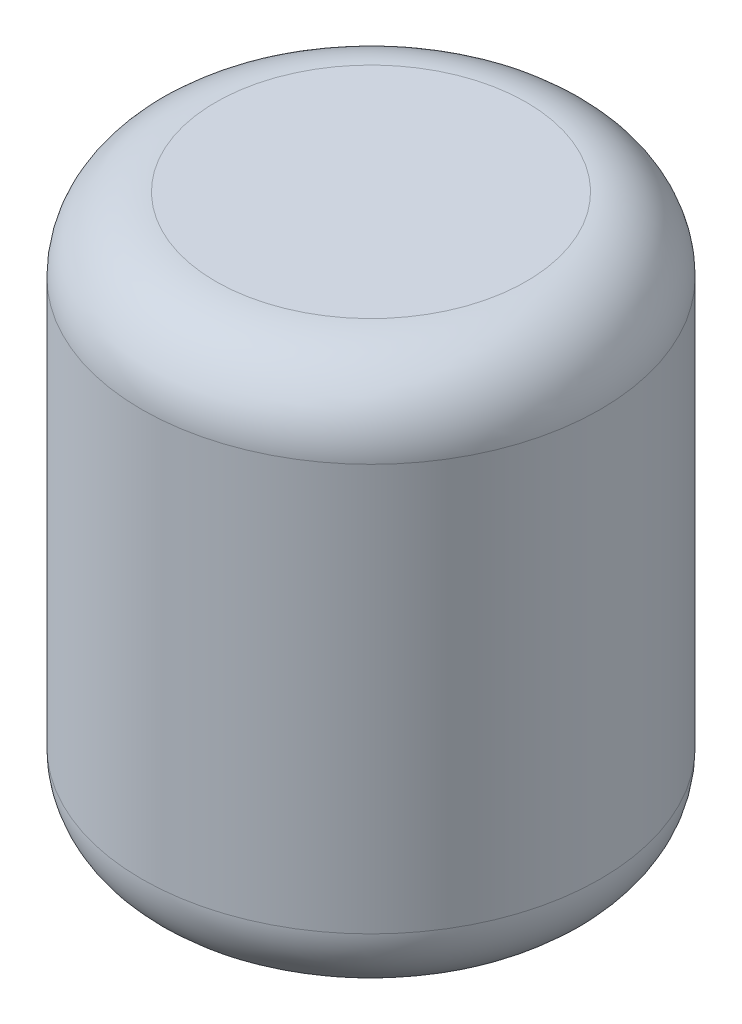
ISO-10303-21;
HEADER;
FILE_DESCRIPTION(('STEP AP214'),'2;1');
FILE_NAME('part.step','',(''),(''),'','','');
FILE_SCHEMA(('AUTOMOTIVE_DESIGN { 1 0 10303 214 1 1 1 1 }'));
ENDSEC;
DATA;
#1=APPLICATION_CONTEXT('core data for automotive mechanical design processes');
#2=APPLICATION_PROTOCOL_DEFINITION('international standard','automotive_design',2000,#1);
#3=PRODUCT_CONTEXT('',#1,'mechanical');
#4=PRODUCT('Part','Part','',(#3));
#5=PRODUCT_RELATED_PRODUCT_CATEGORY('part','',(#4));
#6=PRODUCT_DEFINITION_FORMATION('','',#4);
#7=PRODUCT_DEFINITION_CONTEXT('part definition',#1,'design');
#8=PRODUCT_DEFINITION('design','',#6,#7);
#9=PRODUCT_DEFINITION_SHAPE('','',#8);
#10=(LENGTH_UNIT() NAMED_UNIT(*) SI_UNIT(.MILLI.,.METRE.));
#11=(NAMED_UNIT(*) PLANE_ANGLE_UNIT() SI_UNIT($,.RADIAN.));
#12=(NAMED_UNIT(*) SI_UNIT($,.STERADIAN.) SOLID_ANGLE_UNIT());
#13=UNCERTAINTY_MEASURE_WITH_UNIT(LENGTH_MEASURE(1.E-05),#10,'distance_accuracy_value','');
#14=(GEOMETRIC_REPRESENTATION_CONTEXT(3) GLOBAL_UNCERTAINTY_ASSIGNED_CONTEXT((#13)) GLOBAL_UNIT_ASSIGNED_CONTEXT((#10,
#11,#12)) REPRESENTATION_CONTEXT('',''));
#15=CARTESIAN_POINT('',(0.,0.,0.));
#16=DIRECTION('',(0.,0.,1.));
#17=DIRECTION('',(1.,0.,0.));
#18=AXIS2_PLACEMENT_3D('',#15,#16,#17);
#19=CARTESIAN_POINT('',(0.,37.5,0.));
#20=DIRECTION('',(0.,-1.,0.));
#21=DIRECTION('',(0.,0.,-1.));
#22=AXIS2_PLACEMENT_3D('',#19,#20,#21);
#23=CYLINDRICAL_SURFACE('',#22,31.);
#24=CARTESIAN_POINT('',(0.,27.5,0.));
#25=DIRECTION('',(0.,1.,0.));
#26=DIRECTION('',(0.,0.,1.));
#27=AXIS2_PLACEMENT_3D('',#24,#25,#26);
#28=CIRCLE('',#27,31.);
#29=CARTESIAN_POINT('',(0.,27.5,31.));
#30=VERTEX_POINT('',#29);
#31=EDGE_CURVE('E42',#30,#30,#28,.F.);
#32=ORIENTED_EDGE('',*,*,#31,.T.);
#33=EDGE_LOOP('',(#32));
#34=FACE_BOUND('',#33,.T.);
#35=CARTESIAN_POINT('',(0.,-27.5,0.));
#36=DIRECTION('',(0.,1.,0.));
#37=DIRECTION('',(0.,0.,1.));
#38=AXIS2_PLACEMENT_3D('',#35,#36,#37);
#39=CIRCLE('',#38,31.);
#40=CARTESIAN_POINT('',(0.,-27.5,31.));
#41=VERTEX_POINT('',#40);
#42=EDGE_CURVE('E46',#41,#41,#39,.T.);
#43=ORIENTED_EDGE('',*,*,#42,.T.);
#44=EDGE_LOOP('',(#43));
#45=FACE_BOUND('',#44,.T.);
#46=ADVANCED_FACE('F35',(#34,#45),#23,.T.);
#47=CARTESIAN_POINT('',(0.,37.5,0.));
#48=DIRECTION('',(0.,1.,0.));
#49=DIRECTION('',(0.,0.,1.));
#50=AXIS2_PLACEMENT_3D('',#47,#48,#49);
#51=PLANE('',#50);
#52=CARTESIAN_POINT('',(0.,37.5,0.));
#53=DIRECTION('',(0.,1.,0.));
#54=DIRECTION('',(0.,0.,1.));
#55=AXIS2_PLACEMENT_3D('',#52,#53,#54);
#56=CIRCLE('',#55,21.);
#57=CARTESIAN_POINT('',(0.,37.5,21.));
#58=VERTEX_POINT('',#57);
#59=EDGE_CURVE('E50',#58,#58,#56,.T.);
#60=ORIENTED_EDGE('',*,*,#59,.T.);
#61=EDGE_LOOP('',(#60));
#62=FACE_BOUND('',#61,.T.);
#63=ADVANCED_FACE('F56',(#62),#51,.T.);
#64=CARTESIAN_POINT('',(0.,-37.5,0.));
#65=DIRECTION('',(0.,1.,0.));
#66=DIRECTION('',(0.,0.,1.));
#67=AXIS2_PLACEMENT_3D('',#64,#65,#66);
#68=PLANE('',#67);
#69=CARTESIAN_POINT('',(0.,-37.5,0.));
#70=DIRECTION('',(0.,1.,0.));
#71=DIRECTION('',(0.,0.,1.));
#72=AXIS2_PLACEMENT_3D('',#69,#70,#71);
#73=CIRCLE('',#72,21.);
#74=CARTESIAN_POINT('',(0.,-37.5,21.));
#75=VERTEX_POINT('',#74);
#76=EDGE_CURVE('E10',#75,#75,#73,.F.);
#77=ORIENTED_EDGE('',*,*,#76,.T.);
#78=EDGE_LOOP('',(#77));
#79=FACE_BOUND('',#78,.T.);
#80=ADVANCED_FACE('F60',(#79),#68,.F.);
#81=CARTESIAN_POINT('',(0.,27.5,0.));
#82=DIRECTION('',(0.,1.,0.));
#83=DIRECTION('',(0.,0.,1.));
#84=AXIS2_PLACEMENT_3D('',#81,#82,#83);
#85=TOROIDAL_SURFACE('',#84,21.,10.);
#86=ORIENTED_EDGE('',*,*,#31,.F.);
#87=EDGE_LOOP('',(#86));
#88=FACE_BOUND('',#87,.T.);
#89=ORIENTED_EDGE('',*,*,#59,.F.);
#90=EDGE_LOOP('',(#89));
#91=FACE_BOUND('',#90,.T.);
#92=ADVANCED_FACE('F58',(#88,#91),#85,.T.);
#93=CARTESIAN_POINT('',(0.,-27.5,0.));
#94=DIRECTION('',(0.,1.,0.));
#95=DIRECTION('',(0.,0.,1.));
#96=AXIS2_PLACEMENT_3D('',#93,#94,#95);
#97=TOROIDAL_SURFACE('',#96,21.,10.);
#98=ORIENTED_EDGE('',*,*,#76,.F.);
#99=EDGE_LOOP('',(#98));
#100=FACE_BOUND('',#99,.T.);
#101=ORIENTED_EDGE('',*,*,#42,.F.);
#102=EDGE_LOOP('',(#101));
#103=FACE_BOUND('',#102,.T.);
#104=ADVANCED_FACE('F37',(#100,#103),#97,.T.);
#105=CLOSED_SHELL('',(#46,#63,#80,#92,#104));
#106=MANIFOLD_SOLID_BREP('B2',#105);
#107=ADVANCED_BREP_SHAPE_REPRESENTATION('',(#18,#106),#14);
#108=SHAPE_DEFINITION_REPRESENTATION(#9,#107);
ENDSEC;
END-ISO-10303-21;
